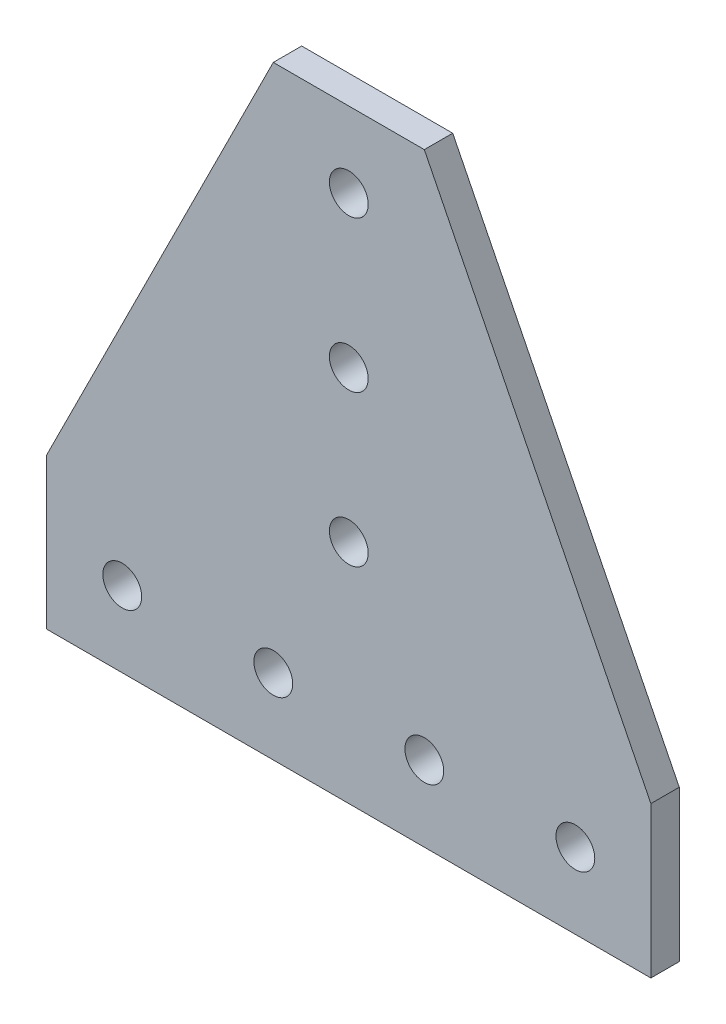
ISO-10303-21;
HEADER;
FILE_DESCRIPTION(('STEP AP214'),'2;1');
FILE_NAME('part.step','',(''),(''),'','','');
FILE_SCHEMA(('AUTOMOTIVE_DESIGN { 1 0 10303 214 1 1 1 1 }'));
ENDSEC;
DATA;
#1=APPLICATION_CONTEXT('core data for automotive mechanical design processes');
#2=APPLICATION_PROTOCOL_DEFINITION('international standard','automotive_design',2000,#1);
#3=PRODUCT_CONTEXT('',#1,'mechanical');
#4=PRODUCT('Part','Part','',(#3));
#5=PRODUCT_RELATED_PRODUCT_CATEGORY('part','',(#4));
#6=PRODUCT_DEFINITION_FORMATION('','',#4);
#7=PRODUCT_DEFINITION_CONTEXT('part definition',#1,'design');
#8=PRODUCT_DEFINITION('design','',#6,#7);
#9=PRODUCT_DEFINITION_SHAPE('','',#8);
#10=(LENGTH_UNIT() NAMED_UNIT(*) SI_UNIT(.MILLI.,.METRE.));
#11=(NAMED_UNIT(*) PLANE_ANGLE_UNIT() SI_UNIT($,.RADIAN.));
#12=(NAMED_UNIT(*) SI_UNIT($,.STERADIAN.) SOLID_ANGLE_UNIT());
#13=UNCERTAINTY_MEASURE_WITH_UNIT(LENGTH_MEASURE(1.E-05),#10,'distance_accuracy_value','');
#14=(GEOMETRIC_REPRESENTATION_CONTEXT(3) GLOBAL_UNCERTAINTY_ASSIGNED_CONTEXT((#13)) GLOBAL_UNIT_ASSIGNED_CONTEXT((#10,
#11,#12)) REPRESENTATION_CONTEXT('',''));
#15=CARTESIAN_POINT('',(0.,0.,0.));
#16=DIRECTION('',(0.,0.,1.));
#17=DIRECTION('',(1.,0.,0.));
#18=AXIS2_PLACEMENT_3D('',#15,#16,#17);
#19=CARTESIAN_POINT('',(50.8,-25.4,-2.3876));
#20=DIRECTION('',(0.894427190999916,0.447213595499958,0.));
#21=DIRECTION('',(-0.447213595499958,0.894427190999916,0.));
#22=AXIS2_PLACEMENT_3D('',#19,#20,#21);
#23=PLANE('',#22);
#24=DIRECTION('',(0.,0.,1.));
#25=VECTOR('',#24,1.);
#26=CARTESIAN_POINT('',(12.7,50.8,-2.3876));
#27=LINE('',#26,#25);
#28=CARTESIAN_POINT('',(12.7,50.8,-2.3876));
#29=VERTEX_POINT('',#28);
#30=CARTESIAN_POINT('',(12.7,50.8,2.3876));
#31=VERTEX_POINT('',#30);
#32=EDGE_CURVE('E42',#29,#31,#27,.T.);
#33=ORIENTED_EDGE('',*,*,#32,.T.);
#34=DIRECTION('',(-0.447213595499958,0.894427190999916,0.));
#35=VECTOR('',#34,1.);
#36=CARTESIAN_POINT('',(50.8,-25.4,2.3876));
#37=LINE('',#36,#35);
#38=CARTESIAN_POINT('',(50.8,-25.4,2.3876));
#39=VERTEX_POINT('',#38);
#40=EDGE_CURVE('E91',#39,#31,#37,.T.);
#41=ORIENTED_EDGE('',*,*,#40,.F.);
#42=DIRECTION('',(0.,0.,1.));
#43=VECTOR('',#42,1.);
#44=CARTESIAN_POINT('',(50.8,-25.4,-2.3876));
#45=LINE('',#44,#43);
#46=CARTESIAN_POINT('',(50.8,-25.4,-2.3876));
#47=VERTEX_POINT('',#46);
#48=EDGE_CURVE('E11',#47,#39,#45,.T.);
#49=ORIENTED_EDGE('',*,*,#48,.F.);
#50=DIRECTION('',(-0.447213595499958,0.894427190999916,0.));
#51=VECTOR('',#50,1.);
#52=CARTESIAN_POINT('',(50.8,-25.4,-2.3876));
#53=LINE('',#52,#51);
#54=EDGE_CURVE('E92',#47,#29,#53,.T.);
#55=ORIENTED_EDGE('',*,*,#54,.T.);
#56=EDGE_LOOP('',(#33,#41,#49,#55));
#57=FACE_BOUND('',#56,.T.);
#58=ADVANCED_FACE('F39',(#57),#23,.T.);
#59=CARTESIAN_POINT('',(50.8,-50.8,-2.3876));
#60=DIRECTION('',(1.,0.,0.));
#61=DIRECTION('',(0.,1.,0.));
#62=AXIS2_PLACEMENT_3D('',#59,#60,#61);
#63=PLANE('',#62);
#64=ORIENTED_EDGE('',*,*,#48,.T.);
#65=DIRECTION('',(0.,1.,0.));
#66=VECTOR('',#65,1.);
#67=CARTESIAN_POINT('',(50.8,-50.8,2.3876));
#68=LINE('',#67,#66);
#69=CARTESIAN_POINT('',(50.8,-50.8,2.3876));
#70=VERTEX_POINT('',#69);
#71=EDGE_CURVE('E110',#70,#39,#68,.T.);
#72=ORIENTED_EDGE('',*,*,#71,.F.);
#73=DIRECTION('',(0.,0.,1.));
#74=VECTOR('',#73,1.);
#75=CARTESIAN_POINT('',(50.8,-50.8,-2.3876));
#76=LINE('',#75,#74);
#77=CARTESIAN_POINT('',(50.8,-50.8,-2.3876));
#78=VERTEX_POINT('',#77);
#79=EDGE_CURVE('E47',#78,#70,#76,.T.);
#80=ORIENTED_EDGE('',*,*,#79,.F.);
#81=DIRECTION('',(0.,1.,0.));
#82=VECTOR('',#81,1.);
#83=CARTESIAN_POINT('',(50.8,-50.8,-2.3876));
#84=LINE('',#83,#82);
#85=EDGE_CURVE('E97',#78,#47,#84,.T.);
#86=ORIENTED_EDGE('',*,*,#85,.T.);
#87=EDGE_LOOP('',(#64,#72,#80,#86));
#88=FACE_BOUND('',#87,.T.);
#89=ADVANCED_FACE('F154',(#88),#63,.T.);
#90=CARTESIAN_POINT('',(50.8,-50.8,-2.3876));
#91=DIRECTION('',(0.,1.,0.));
#92=DIRECTION('',(0.,0.,1.));
#93=AXIS2_PLACEMENT_3D('',#90,#91,#92);
#94=PLANE('',#93);
#95=ORIENTED_EDGE('',*,*,#79,.T.);
#96=DIRECTION('',(-1.,0.,0.));
#97=VECTOR('',#96,1.);
#98=CARTESIAN_POINT('',(50.8,-50.8,2.3876));
#99=LINE('',#98,#97);
#100=CARTESIAN_POINT('',(-50.8,-50.8,2.3876));
#101=VERTEX_POINT('',#100);
#102=EDGE_CURVE('E124',#70,#101,#99,.T.);
#103=ORIENTED_EDGE('',*,*,#102,.T.);
#104=DIRECTION('',(0.,0.,1.));
#105=VECTOR('',#104,1.);
#106=CARTESIAN_POINT('',(-50.8,-50.8,-2.3876));
#107=LINE('',#106,#105);
#108=CARTESIAN_POINT('',(-50.8,-50.8,-2.3876));
#109=VERTEX_POINT('',#108);
#110=EDGE_CURVE('E139',#109,#101,#107,.T.);
#111=ORIENTED_EDGE('',*,*,#110,.F.);
#112=DIRECTION('',(-1.,0.,0.));
#113=VECTOR('',#112,1.);
#114=CARTESIAN_POINT('',(50.8,-50.8,-2.3876));
#115=LINE('',#114,#113);
#116=EDGE_CURVE('E135',#78,#109,#115,.T.);
#117=ORIENTED_EDGE('',*,*,#116,.F.);
#118=EDGE_LOOP('',(#95,#103,#111,#117));
#119=FACE_BOUND('',#118,.T.);
#120=ADVANCED_FACE('F152',(#119),#94,.F.);
#121=CARTESIAN_POINT('',(-50.8,-50.8,-2.3876));
#122=DIRECTION('',(1.,0.,0.));
#123=DIRECTION('',(0.,1.,0.));
#124=AXIS2_PLACEMENT_3D('',#121,#122,#123);
#125=PLANE('',#124);
#126=ORIENTED_EDGE('',*,*,#110,.T.);
#127=DIRECTION('',(0.,1.,0.));
#128=VECTOR('',#127,1.);
#129=CARTESIAN_POINT('',(-50.8,-50.8,2.3876));
#130=LINE('',#129,#128);
#131=CARTESIAN_POINT('',(-50.8,-25.4,2.3876));
#132=VERTEX_POINT('',#131);
#133=EDGE_CURVE('E121',#101,#132,#130,.T.);
#134=ORIENTED_EDGE('',*,*,#133,.T.);
#135=DIRECTION('',(0.,0.,1.));
#136=VECTOR('',#135,1.);
#137=CARTESIAN_POINT('',(-50.8,-25.4,-2.3876));
#138=LINE('',#137,#136);
#139=CARTESIAN_POINT('',(-50.8,-25.4,-2.3876));
#140=VERTEX_POINT('',#139);
#141=EDGE_CURVE('E141',#140,#132,#138,.T.);
#142=ORIENTED_EDGE('',*,*,#141,.F.);
#143=DIRECTION('',(0.,1.,0.));
#144=VECTOR('',#143,1.);
#145=CARTESIAN_POINT('',(-50.8,-50.8,-2.3876));
#146=LINE('',#145,#144);
#147=EDGE_CURVE('E133',#109,#140,#146,.T.);
#148=ORIENTED_EDGE('',*,*,#147,.F.);
#149=EDGE_LOOP('',(#126,#134,#142,#148));
#150=FACE_BOUND('',#149,.T.);
#151=ADVANCED_FACE('F149',(#150),#125,.F.);
#152=CARTESIAN_POINT('',(-50.8,-25.4,-2.3876));
#153=DIRECTION('',(0.894427190999916,-0.447213595499958,0.));
#154=DIRECTION('',(0.447213595499958,0.894427190999916,0.));
#155=AXIS2_PLACEMENT_3D('',#152,#153,#154);
#156=PLANE('',#155);
#157=ORIENTED_EDGE('',*,*,#141,.T.);
#158=DIRECTION('',(0.447213595499958,0.894427190999916,0.));
#159=VECTOR('',#158,1.);
#160=CARTESIAN_POINT('',(-50.8,-25.4,2.3876));
#161=LINE('',#160,#159);
#162=CARTESIAN_POINT('',(-12.7,50.8,2.3876));
#163=VERTEX_POINT('',#162);
#164=EDGE_CURVE('E105',#132,#163,#161,.T.);
#165=ORIENTED_EDGE('',*,*,#164,.T.);
#166=DIRECTION('',(0.,0.,1.));
#167=VECTOR('',#166,1.);
#168=CARTESIAN_POINT('',(-12.7,50.8,-2.3876));
#169=LINE('',#168,#167);
#170=CARTESIAN_POINT('',(-12.7,50.8,-2.3876));
#171=VERTEX_POINT('',#170);
#172=EDGE_CURVE('E96',#171,#163,#169,.T.);
#173=ORIENTED_EDGE('',*,*,#172,.F.);
#174=DIRECTION('',(0.447213595499958,0.894427190999916,0.));
#175=VECTOR('',#174,1.);
#176=CARTESIAN_POINT('',(-50.8,-25.4,-2.3876));
#177=LINE('',#176,#175);
#178=EDGE_CURVE('E131',#140,#171,#177,.T.);
#179=ORIENTED_EDGE('',*,*,#178,.F.);
#180=EDGE_LOOP('',(#157,#165,#173,#179));
#181=FACE_BOUND('',#180,.T.);
#182=ADVANCED_FACE('F145',(#181),#156,.F.);
#183=CARTESIAN_POINT('',(12.7,50.8,-2.3876));
#184=DIRECTION('',(0.,1.,0.));
#185=DIRECTION('',(0.,0.,1.));
#186=AXIS2_PLACEMENT_3D('',#183,#184,#185);
#187=PLANE('',#186);
#188=ORIENTED_EDGE('',*,*,#172,.T.);
#189=DIRECTION('',(-1.,0.,0.));
#190=VECTOR('',#189,1.);
#191=CARTESIAN_POINT('',(12.7,50.8,2.3876));
#192=LINE('',#191,#190);
#193=EDGE_CURVE('E99',#31,#163,#192,.T.);
#194=ORIENTED_EDGE('',*,*,#193,.F.);
#195=ORIENTED_EDGE('',*,*,#32,.F.);
#196=DIRECTION('',(-1.,0.,0.));
#197=VECTOR('',#196,1.);
#198=CARTESIAN_POINT('',(12.7,50.8,-2.3876));
#199=LINE('',#198,#197);
#200=EDGE_CURVE('E129',#29,#171,#199,.T.);
#201=ORIENTED_EDGE('',*,*,#200,.T.);
#202=EDGE_LOOP('',(#188,#194,#195,#201));
#203=FACE_BOUND('',#202,.T.);
#204=ADVANCED_FACE('F100',(#203),#187,.T.);
#205=CARTESIAN_POINT('',(0.,0.,-2.3876));
#206=DIRECTION('',(0.,0.,1.));
#207=DIRECTION('',(1.,0.,0.));
#208=AXIS2_PLACEMENT_3D('',#205,#206,#207);
#209=PLANE('',#208);
#210=CARTESIAN_POINT('',(-38.1,-38.1,-2.3876));
#211=DIRECTION('',(0.,0.,1.));
#212=DIRECTION('',(1.,0.,0.));
#213=AXIS2_PLACEMENT_3D('',#210,#211,#212);
#214=CIRCLE('',#213,3.26389999999999);
#215=CARTESIAN_POINT('',(-34.8361,-38.1,-2.3876));
#216=VERTEX_POINT('',#215);
#217=EDGE_CURVE('E111',#216,#216,#214,.T.);
#218=ORIENTED_EDGE('',*,*,#217,.T.);
#219=EDGE_LOOP('',(#218));
#220=FACE_BOUND('',#219,.T.);
#221=CARTESIAN_POINT('',(9.31178073069464E-13,-12.7,-2.3876));
#222=DIRECTION('',(0.,0.,1.));
#223=DIRECTION('',(1.,0.,0.));
#224=AXIS2_PLACEMENT_3D('',#221,#222,#223);
#225=CIRCLE('',#224,3.2639);
#226=CARTESIAN_POINT('',(3.26390000000093,-12.7,-2.3876));
#227=VERTEX_POINT('',#226);
#228=EDGE_CURVE('E290',#227,#227,#225,.T.);
#229=ORIENTED_EDGE('',*,*,#228,.T.);
#230=EDGE_LOOP('',(#229));
#231=FACE_BOUND('',#230,.T.);
#232=CARTESIAN_POINT('',(38.1,-38.1,-2.3876));
#233=DIRECTION('',(0.,0.,1.));
#234=DIRECTION('',(1.,0.,0.));
#235=AXIS2_PLACEMENT_3D('',#232,#233,#234);
#236=CIRCLE('',#235,3.26389999999999);
#237=CARTESIAN_POINT('',(41.3639,-38.1,-2.3876));
#238=VERTEX_POINT('',#237);
#239=EDGE_CURVE('E283',#238,#238,#236,.T.);
#240=ORIENTED_EDGE('',*,*,#239,.T.);
#241=EDGE_LOOP('',(#240));
#242=FACE_BOUND('',#241,.T.);
#243=CARTESIAN_POINT('',(3.9907631702977E-13,38.1,-2.3876));
#244=DIRECTION('',(0.,0.,1.));
#245=DIRECTION('',(1.,0.,0.));
#246=AXIS2_PLACEMENT_3D('',#243,#244,#245);
#247=CIRCLE('',#246,3.2639);
#248=CARTESIAN_POINT('',(3.2639000000004,38.1,-2.3876));
#249=VERTEX_POINT('',#248);
#250=EDGE_CURVE('E277',#249,#249,#247,.T.);
#251=ORIENTED_EDGE('',*,*,#250,.T.);
#252=EDGE_LOOP('',(#251));
#253=FACE_BOUND('',#252,.T.);
#254=CARTESIAN_POINT('',(-12.7,-38.1,-2.3876));
#255=DIRECTION('',(0.,0.,1.));
#256=DIRECTION('',(1.,0.,0.));
#257=AXIS2_PLACEMENT_3D('',#254,#255,#256);
#258=CIRCLE('',#257,3.26389999999999);
#259=CARTESIAN_POINT('',(-9.43610000000001,-38.1,-2.3876));
#260=VERTEX_POINT('',#259);
#261=EDGE_CURVE('E308',#260,#260,#258,.T.);
#262=ORIENTED_EDGE('',*,*,#261,.T.);
#263=EDGE_LOOP('',(#262));
#264=FACE_BOUND('',#263,.T.);
#265=CARTESIAN_POINT('',(12.7,-38.1,-2.3876));
#266=DIRECTION('',(0.,0.,1.));
#267=DIRECTION('',(1.,0.,0.));
#268=AXIS2_PLACEMENT_3D('',#265,#266,#267);
#269=CIRCLE('',#268,3.26389999999999);
#270=CARTESIAN_POINT('',(15.9639,-38.1,-2.3876));
#271=VERTEX_POINT('',#270);
#272=EDGE_CURVE('E296',#271,#271,#269,.T.);
#273=ORIENTED_EDGE('',*,*,#272,.T.);
#274=EDGE_LOOP('',(#273));
#275=FACE_BOUND('',#274,.T.);
#276=CARTESIAN_POINT('',(6.65127195049617E-13,12.7,-2.3876));
#277=DIRECTION('',(0.,0.,1.));
#278=DIRECTION('',(1.,0.,0.));
#279=AXIS2_PLACEMENT_3D('',#276,#277,#278);
#280=CIRCLE('',#279,3.2639);
#281=CARTESIAN_POINT('',(3.26390000000067,12.7,-2.3876));
#282=VERTEX_POINT('',#281);
#283=EDGE_CURVE('E302',#282,#282,#280,.T.);
#284=ORIENTED_EDGE('',*,*,#283,.T.);
#285=EDGE_LOOP('',(#284));
#286=FACE_BOUND('',#285,.T.);
#287=ORIENTED_EDGE('',*,*,#54,.F.);
#288=ORIENTED_EDGE('',*,*,#85,.F.);
#289=ORIENTED_EDGE('',*,*,#116,.T.);
#290=ORIENTED_EDGE('',*,*,#147,.T.);
#291=ORIENTED_EDGE('',*,*,#178,.T.);
#292=ORIENTED_EDGE('',*,*,#200,.F.);
#293=EDGE_LOOP('',(#287,#288,#289,#290,#291,#292));
#294=FACE_BOUND('',#293,.T.);
#295=ADVANCED_FACE('F156',(#220,#231,#242,#253,#264,#275,#286,#294),#209,.F.);
#296=CARTESIAN_POINT('',(0.,0.,2.3876));
#297=DIRECTION('',(0.,0.,1.));
#298=DIRECTION('',(1.,0.,0.));
#299=AXIS2_PLACEMENT_3D('',#296,#297,#298);
#300=PLANE('',#299);
#301=CARTESIAN_POINT('',(-38.1,-38.1,2.3876));
#302=DIRECTION('',(0.,0.,1.));
#303=DIRECTION('',(1.,0.,0.));
#304=AXIS2_PLACEMENT_3D('',#301,#302,#303);
#305=CIRCLE('',#304,3.26389999999999);
#306=CARTESIAN_POINT('',(-34.8361,-38.1,2.3876));
#307=VERTEX_POINT('',#306);
#308=EDGE_CURVE('E114',#307,#307,#305,.T.);
#309=ORIENTED_EDGE('',*,*,#308,.F.);
#310=EDGE_LOOP('',(#309));
#311=FACE_BOUND('',#310,.T.);
#312=CARTESIAN_POINT('',(9.31178073069464E-13,-12.7,2.3876));
#313=DIRECTION('',(0.,0.,1.));
#314=DIRECTION('',(1.,0.,0.));
#315=AXIS2_PLACEMENT_3D('',#312,#313,#314);
#316=CIRCLE('',#315,3.2639);
#317=CARTESIAN_POINT('',(3.26390000000093,-12.7,2.3876));
#318=VERTEX_POINT('',#317);
#319=EDGE_CURVE('E293',#318,#318,#316,.T.);
#320=ORIENTED_EDGE('',*,*,#319,.F.);
#321=EDGE_LOOP('',(#320));
#322=FACE_BOUND('',#321,.T.);
#323=CARTESIAN_POINT('',(38.1,-38.1,2.3876));
#324=DIRECTION('',(0.,0.,1.));
#325=DIRECTION('',(1.,0.,0.));
#326=AXIS2_PLACEMENT_3D('',#323,#324,#325);
#327=CIRCLE('',#326,3.26389999999999);
#328=CARTESIAN_POINT('',(41.3639,-38.1,2.3876));
#329=VERTEX_POINT('',#328);
#330=EDGE_CURVE('E287',#329,#329,#327,.T.);
#331=ORIENTED_EDGE('',*,*,#330,.F.);
#332=EDGE_LOOP('',(#331));
#333=FACE_BOUND('',#332,.T.);
#334=CARTESIAN_POINT('',(3.9907631702977E-13,38.1,2.3876));
#335=DIRECTION('',(0.,0.,1.));
#336=DIRECTION('',(1.,0.,0.));
#337=AXIS2_PLACEMENT_3D('',#334,#335,#336);
#338=CIRCLE('',#337,3.2639);
#339=CARTESIAN_POINT('',(3.2639000000004,38.1,2.3876));
#340=VERTEX_POINT('',#339);
#341=EDGE_CURVE('E280',#340,#340,#338,.T.);
#342=ORIENTED_EDGE('',*,*,#341,.F.);
#343=EDGE_LOOP('',(#342));
#344=FACE_BOUND('',#343,.T.);
#345=CARTESIAN_POINT('',(-12.7,-38.1,2.3876));
#346=DIRECTION('',(0.,0.,1.));
#347=DIRECTION('',(1.,0.,0.));
#348=AXIS2_PLACEMENT_3D('',#345,#346,#347);
#349=CIRCLE('',#348,3.26389999999999);
#350=CARTESIAN_POINT('',(-9.43610000000001,-38.1,2.3876));
#351=VERTEX_POINT('',#350);
#352=EDGE_CURVE('E117',#351,#351,#349,.T.);
#353=ORIENTED_EDGE('',*,*,#352,.F.);
#354=EDGE_LOOP('',(#353));
#355=FACE_BOUND('',#354,.T.);
#356=CARTESIAN_POINT('',(12.7,-38.1,2.3876));
#357=DIRECTION('',(0.,0.,1.));
#358=DIRECTION('',(1.,0.,0.));
#359=AXIS2_PLACEMENT_3D('',#356,#357,#358);
#360=CIRCLE('',#359,3.26389999999999);
#361=CARTESIAN_POINT('',(15.9639,-38.1,2.3876));
#362=VERTEX_POINT('',#361);
#363=EDGE_CURVE('E299',#362,#362,#360,.T.);
#364=ORIENTED_EDGE('',*,*,#363,.F.);
#365=EDGE_LOOP('',(#364));
#366=FACE_BOUND('',#365,.T.);
#367=CARTESIAN_POINT('',(6.65127195049617E-13,12.7,2.3876));
#368=DIRECTION('',(0.,0.,1.));
#369=DIRECTION('',(1.,0.,0.));
#370=AXIS2_PLACEMENT_3D('',#367,#368,#369);
#371=CIRCLE('',#370,3.2639);
#372=CARTESIAN_POINT('',(3.26390000000067,12.7,2.3876));
#373=VERTEX_POINT('',#372);
#374=EDGE_CURVE('E286',#373,#373,#371,.T.);
#375=ORIENTED_EDGE('',*,*,#374,.F.);
#376=EDGE_LOOP('',(#375));
#377=FACE_BOUND('',#376,.T.);
#378=ORIENTED_EDGE('',*,*,#40,.T.);
#379=ORIENTED_EDGE('',*,*,#193,.T.);
#380=ORIENTED_EDGE('',*,*,#164,.F.);
#381=ORIENTED_EDGE('',*,*,#133,.F.);
#382=ORIENTED_EDGE('',*,*,#102,.F.);
#383=ORIENTED_EDGE('',*,*,#71,.T.);
#384=EDGE_LOOP('',(#378,#379,#380,#381,#382,#383));
#385=FACE_BOUND('',#384,.T.);
#386=ADVANCED_FACE('F108',(#311,#322,#333,#344,#355,#366,#377,#385),#300,.T.);
#387=CARTESIAN_POINT('',(6.65127195049617E-13,12.7,-2.3876));
#388=DIRECTION('',(0.,0.,1.));
#389=DIRECTION('',(1.,0.,0.));
#390=AXIS2_PLACEMENT_3D('',#387,#388,#389);
#391=CYLINDRICAL_SURFACE('',#390,3.2639);
#392=ORIENTED_EDGE('',*,*,#283,.F.);
#393=EDGE_LOOP('',(#392));
#394=FACE_BOUND('',#393,.T.);
#395=ORIENTED_EDGE('',*,*,#374,.T.);
#396=EDGE_LOOP('',(#395));
#397=FACE_BOUND('',#396,.T.);
#398=ADVANCED_FACE('F164',(#394,#397),#391,.F.);
#399=CARTESIAN_POINT('',(12.7,-38.1,-2.3876));
#400=DIRECTION('',(0.,0.,1.));
#401=DIRECTION('',(1.,0.,0.));
#402=AXIS2_PLACEMENT_3D('',#399,#400,#401);
#403=CYLINDRICAL_SURFACE('',#402,3.26389999999999);
#404=ORIENTED_EDGE('',*,*,#272,.F.);
#405=EDGE_LOOP('',(#404));
#406=FACE_BOUND('',#405,.T.);
#407=ORIENTED_EDGE('',*,*,#363,.T.);
#408=EDGE_LOOP('',(#407));
#409=FACE_BOUND('',#408,.T.);
#410=ADVANCED_FACE('F210',(#406,#409),#403,.F.);
#411=CARTESIAN_POINT('',(-12.7,-38.1,-2.3876));
#412=DIRECTION('',(0.,0.,1.));
#413=DIRECTION('',(1.,0.,0.));
#414=AXIS2_PLACEMENT_3D('',#411,#412,#413);
#415=CYLINDRICAL_SURFACE('',#414,3.26389999999999);
#416=ORIENTED_EDGE('',*,*,#261,.F.);
#417=EDGE_LOOP('',(#416));
#418=FACE_BOUND('',#417,.T.);
#419=ORIENTED_EDGE('',*,*,#352,.T.);
#420=EDGE_LOOP('',(#419));
#421=FACE_BOUND('',#420,.T.);
#422=ADVANCED_FACE('F220',(#418,#421),#415,.F.);
#423=CARTESIAN_POINT('',(3.9907631702977E-13,38.1,-2.3876));
#424=DIRECTION('',(0.,0.,1.));
#425=DIRECTION('',(1.,0.,0.));
#426=AXIS2_PLACEMENT_3D('',#423,#424,#425);
#427=CYLINDRICAL_SURFACE('',#426,3.2639);
#428=ORIENTED_EDGE('',*,*,#250,.F.);
#429=EDGE_LOOP('',(#428));
#430=FACE_BOUND('',#429,.T.);
#431=ORIENTED_EDGE('',*,*,#341,.T.);
#432=EDGE_LOOP('',(#431));
#433=FACE_BOUND('',#432,.T.);
#434=ADVANCED_FACE('F230',(#430,#433),#427,.F.);
#435=CARTESIAN_POINT('',(38.1,-38.1,-2.3876));
#436=DIRECTION('',(0.,0.,1.));
#437=DIRECTION('',(1.,0.,0.));
#438=AXIS2_PLACEMENT_3D('',#435,#436,#437);
#439=CYLINDRICAL_SURFACE('',#438,3.26389999999999);
#440=ORIENTED_EDGE('',*,*,#239,.F.);
#441=EDGE_LOOP('',(#440));
#442=FACE_BOUND('',#441,.T.);
#443=ORIENTED_EDGE('',*,*,#330,.T.);
#444=EDGE_LOOP('',(#443));
#445=FACE_BOUND('',#444,.T.);
#446=ADVANCED_FACE('F240',(#442,#445),#439,.F.);
#447=CARTESIAN_POINT('',(9.31178073069464E-13,-12.7,-2.3876));
#448=DIRECTION('',(0.,0.,1.));
#449=DIRECTION('',(1.,0.,0.));
#450=AXIS2_PLACEMENT_3D('',#447,#448,#449);
#451=CYLINDRICAL_SURFACE('',#450,3.2639);
#452=ORIENTED_EDGE('',*,*,#228,.F.);
#453=EDGE_LOOP('',(#452));
#454=FACE_BOUND('',#453,.T.);
#455=ORIENTED_EDGE('',*,*,#319,.T.);
#456=EDGE_LOOP('',(#455));
#457=FACE_BOUND('',#456,.T.);
#458=ADVANCED_FACE('F250',(#454,#457),#451,.F.);
#459=CARTESIAN_POINT('',(-38.1,-38.1,-2.3876));
#460=DIRECTION('',(0.,0.,1.));
#461=DIRECTION('',(1.,0.,0.));
#462=AXIS2_PLACEMENT_3D('',#459,#460,#461);
#463=CYLINDRICAL_SURFACE('',#462,3.26389999999999);
#464=ORIENTED_EDGE('',*,*,#217,.F.);
#465=EDGE_LOOP('',(#464));
#466=FACE_BOUND('',#465,.T.);
#467=ORIENTED_EDGE('',*,*,#308,.T.);
#468=EDGE_LOOP('',(#467));
#469=FACE_BOUND('',#468,.T.);
#470=ADVANCED_FACE('F260',(#466,#469),#463,.F.);
#471=CLOSED_SHELL('',(#58,#89,#120,#151,#182,#204,#295,#386,#398,#410,#422,#434,#446,#458,#470));
#472=MANIFOLD_SOLID_BREP('B2',#471);
#473=ADVANCED_BREP_SHAPE_REPRESENTATION('',(#18,#472),#14);
#474=SHAPE_DEFINITION_REPRESENTATION(#9,#473);
ENDSEC;
END-ISO-10303-21;
